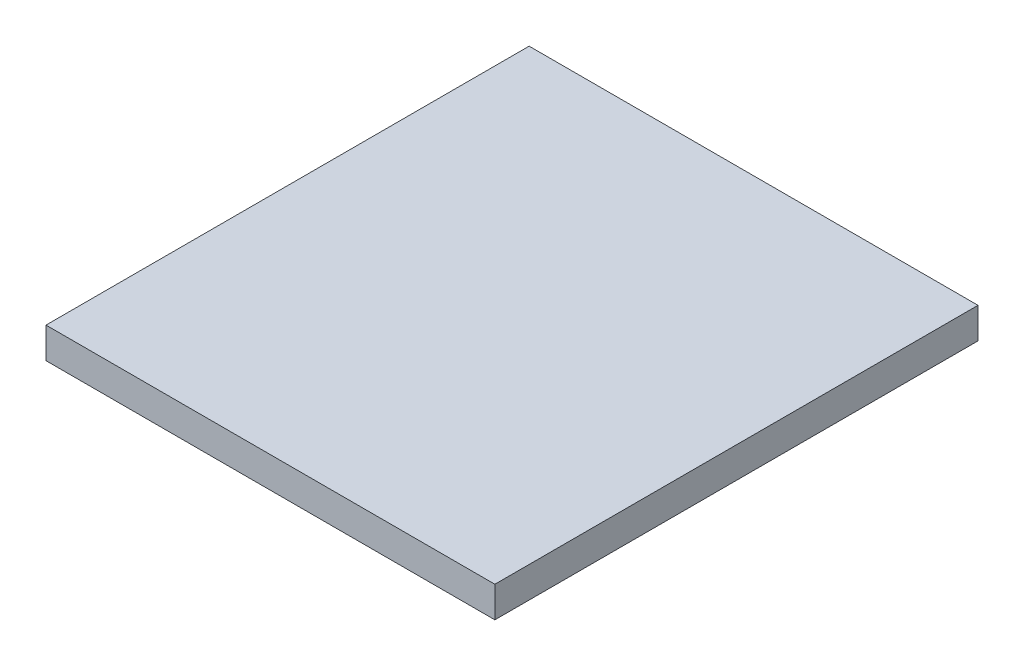
ISO-10303-21;
HEADER;
FILE_DESCRIPTION(('STEP AP214'),'2;1');
FILE_NAME('part.step','',(''),(''),'','','');
FILE_SCHEMA(('AUTOMOTIVE_DESIGN { 1 0 10303 214 1 1 1 1 }'));
ENDSEC;
DATA;
#1=APPLICATION_CONTEXT('core data for automotive mechanical design processes');
#2=APPLICATION_PROTOCOL_DEFINITION('international standard','automotive_design',2000,#1);
#3=PRODUCT_CONTEXT('',#1,'mechanical');
#4=PRODUCT('Part','Part','',(#3));
#5=PRODUCT_RELATED_PRODUCT_CATEGORY('part','',(#4));
#6=PRODUCT_DEFINITION_FORMATION('','',#4);
#7=PRODUCT_DEFINITION_CONTEXT('part definition',#1,'design');
#8=PRODUCT_DEFINITION('design','',#6,#7);
#9=PRODUCT_DEFINITION_SHAPE('','',#8);
#10=(LENGTH_UNIT() NAMED_UNIT(*) SI_UNIT(.MILLI.,.METRE.));
#11=(NAMED_UNIT(*) PLANE_ANGLE_UNIT() SI_UNIT($,.RADIAN.));
#12=(NAMED_UNIT(*) SI_UNIT($,.STERADIAN.) SOLID_ANGLE_UNIT());
#13=UNCERTAINTY_MEASURE_WITH_UNIT(LENGTH_MEASURE(1.E-05),#10,'distance_accuracy_value','');
#14=(GEOMETRIC_REPRESENTATION_CONTEXT(3) GLOBAL_UNCERTAINTY_ASSIGNED_CONTEXT((#13)) GLOBAL_UNIT_ASSIGNED_CONTEXT((#10,
#11,#12)) REPRESENTATION_CONTEXT('',''));
#15=CARTESIAN_POINT('',(0.,0.,0.));
#16=DIRECTION('',(0.,0.,1.));
#17=DIRECTION('',(1.,0.,0.));
#18=AXIS2_PLACEMENT_3D('',#15,#16,#17);
#19=CARTESIAN_POINT('',(-131.,18.,141.));
#20=DIRECTION('',(1.,0.,0.));
#21=DIRECTION('',(0.,0.,-1.));
#22=AXIS2_PLACEMENT_3D('',#19,#20,#21);
#23=PLANE('',#22);
#24=DIRECTION('',(0.,0.,1.));
#25=VECTOR('',#24,1.);
#26=CARTESIAN_POINT('',(-131.,0.,141.));
#27=LINE('',#26,#25);
#28=CARTESIAN_POINT('',(-131.,0.,-141.));
#29=VERTEX_POINT('',#28);
#30=CARTESIAN_POINT('',(-131.,0.,141.));
#31=VERTEX_POINT('',#30);
#32=EDGE_CURVE('E98',#29,#31,#27,.T.);
#33=ORIENTED_EDGE('',*,*,#32,.T.);
#34=DIRECTION('',(0.,-1.,0.));
#35=VECTOR('',#34,1.);
#36=CARTESIAN_POINT('',(-131.,18.,141.));
#37=LINE('',#36,#35);
#38=CARTESIAN_POINT('',(-131.,18.,141.));
#39=VERTEX_POINT('',#38);
#40=EDGE_CURVE('E11',#39,#31,#37,.T.);
#41=ORIENTED_EDGE('',*,*,#40,.F.);
#42=DIRECTION('',(0.,0.,1.));
#43=VECTOR('',#42,1.);
#44=CARTESIAN_POINT('',(-131.,18.,141.));
#45=LINE('',#44,#43);
#46=CARTESIAN_POINT('',(-131.,18.,-141.));
#47=VERTEX_POINT('',#46);
#48=EDGE_CURVE('E86',#47,#39,#45,.T.);
#49=ORIENTED_EDGE('',*,*,#48,.F.);
#50=DIRECTION('',(0.,-1.,0.));
#51=VECTOR('',#50,1.);
#52=CARTESIAN_POINT('',(-131.,18.,-141.));
#53=LINE('',#52,#51);
#54=EDGE_CURVE('E94',#47,#29,#53,.T.);
#55=ORIENTED_EDGE('',*,*,#54,.T.);
#56=EDGE_LOOP('',(#33,#41,#49,#55));
#57=FACE_BOUND('',#56,.T.);
#58=ADVANCED_FACE('F35',(#57),#23,.F.);
#59=CARTESIAN_POINT('',(131.,18.,141.));
#60=DIRECTION('',(0.,0.,-1.));
#61=DIRECTION('',(-1.,0.,0.));
#62=AXIS2_PLACEMENT_3D('',#59,#60,#61);
#63=PLANE('',#62);
#64=DIRECTION('',(1.,0.,0.));
#65=VECTOR('',#64,1.);
#66=CARTESIAN_POINT('',(131.,0.,141.));
#67=LINE('',#66,#65);
#68=CARTESIAN_POINT('',(131.,0.,141.));
#69=VERTEX_POINT('',#68);
#70=EDGE_CURVE('E90',#31,#69,#67,.T.);
#71=ORIENTED_EDGE('',*,*,#70,.T.);
#72=DIRECTION('',(0.,-1.,0.));
#73=VECTOR('',#72,1.);
#74=CARTESIAN_POINT('',(131.,18.,141.));
#75=LINE('',#74,#73);
#76=CARTESIAN_POINT('',(131.,18.,141.));
#77=VERTEX_POINT('',#76);
#78=EDGE_CURVE('E43',#77,#69,#75,.T.);
#79=ORIENTED_EDGE('',*,*,#78,.F.);
#80=DIRECTION('',(1.,0.,0.));
#81=VECTOR('',#80,1.);
#82=CARTESIAN_POINT('',(131.,18.,141.));
#83=LINE('',#82,#81);
#84=EDGE_CURVE('E81',#39,#77,#83,.T.);
#85=ORIENTED_EDGE('',*,*,#84,.F.);
#86=ORIENTED_EDGE('',*,*,#40,.T.);
#87=EDGE_LOOP('',(#71,#79,#85,#86));
#88=FACE_BOUND('',#87,.T.);
#89=ADVANCED_FACE('F89',(#88),#63,.F.);
#90=CARTESIAN_POINT('',(131.,18.,141.));
#91=DIRECTION('',(-1.,0.,0.));
#92=DIRECTION('',(0.,0.,1.));
#93=AXIS2_PLACEMENT_3D('',#90,#91,#92);
#94=PLANE('',#93);
#95=DIRECTION('',(0.,0.,-1.));
#96=VECTOR('',#95,1.);
#97=CARTESIAN_POINT('',(131.,0.,141.));
#98=LINE('',#97,#96);
#99=CARTESIAN_POINT('',(131.,0.,-141.));
#100=VERTEX_POINT('',#99);
#101=EDGE_CURVE('E68',#69,#100,#98,.T.);
#102=ORIENTED_EDGE('',*,*,#101,.T.);
#103=DIRECTION('',(0.,-1.,0.));
#104=VECTOR('',#103,1.);
#105=CARTESIAN_POINT('',(131.,18.,-141.));
#106=LINE('',#105,#104);
#107=CARTESIAN_POINT('',(131.,18.,-141.));
#108=VERTEX_POINT('',#107);
#109=EDGE_CURVE('E91',#108,#100,#106,.T.);
#110=ORIENTED_EDGE('',*,*,#109,.F.);
#111=DIRECTION('',(0.,0.,-1.));
#112=VECTOR('',#111,1.);
#113=CARTESIAN_POINT('',(131.,18.,141.));
#114=LINE('',#113,#112);
#115=EDGE_CURVE('E84',#77,#108,#114,.T.);
#116=ORIENTED_EDGE('',*,*,#115,.F.);
#117=ORIENTED_EDGE('',*,*,#78,.T.);
#118=EDGE_LOOP('',(#102,#110,#116,#117));
#119=FACE_BOUND('',#118,.T.);
#120=ADVANCED_FACE('F92',(#119),#94,.F.);
#121=CARTESIAN_POINT('',(131.,18.,-141.));
#122=DIRECTION('',(0.,0.,1.));
#123=DIRECTION('',(1.,0.,0.));
#124=AXIS2_PLACEMENT_3D('',#121,#122,#123);
#125=PLANE('',#124);
#126=DIRECTION('',(-1.,0.,0.));
#127=VECTOR('',#126,1.);
#128=CARTESIAN_POINT('',(131.,0.,-141.));
#129=LINE('',#128,#127);
#130=EDGE_CURVE('E74',#100,#29,#129,.T.);
#131=ORIENTED_EDGE('',*,*,#130,.T.);
#132=ORIENTED_EDGE('',*,*,#54,.F.);
#133=DIRECTION('',(-1.,0.,0.));
#134=VECTOR('',#133,1.);
#135=CARTESIAN_POINT('',(131.,18.,-141.));
#136=LINE('',#135,#134);
#137=EDGE_CURVE('E51',#108,#47,#136,.T.);
#138=ORIENTED_EDGE('',*,*,#137,.F.);
#139=ORIENTED_EDGE('',*,*,#109,.T.);
#140=EDGE_LOOP('',(#131,#132,#138,#139));
#141=FACE_BOUND('',#140,.T.);
#142=ADVANCED_FACE('F105',(#141),#125,.F.);
#143=CARTESIAN_POINT('',(0.,18.,0.));
#144=DIRECTION('',(0.,1.,0.));
#145=DIRECTION('',(0.,0.,1.));
#146=AXIS2_PLACEMENT_3D('',#143,#144,#145);
#147=PLANE('',#146);
#148=ORIENTED_EDGE('',*,*,#48,.T.);
#149=ORIENTED_EDGE('',*,*,#84,.T.);
#150=ORIENTED_EDGE('',*,*,#115,.T.);
#151=ORIENTED_EDGE('',*,*,#137,.T.);
#152=EDGE_LOOP('',(#148,#149,#150,#151));
#153=FACE_BOUND('',#152,.T.);
#154=ADVANCED_FACE('F82',(#153),#147,.T.);
#155=CARTESIAN_POINT('',(0.,0.,0.));
#156=DIRECTION('',(0.,1.,0.));
#157=DIRECTION('',(0.,0.,1.));
#158=AXIS2_PLACEMENT_3D('',#155,#156,#157);
#159=PLANE('',#158);
#160=ORIENTED_EDGE('',*,*,#32,.F.);
#161=ORIENTED_EDGE('',*,*,#130,.F.);
#162=ORIENTED_EDGE('',*,*,#101,.F.);
#163=ORIENTED_EDGE('',*,*,#70,.F.);
#164=EDGE_LOOP('',(#160,#161,#162,#163));
#165=FACE_BOUND('',#164,.T.);
#166=ADVANCED_FACE('F108',(#165),#159,.F.);
#167=CLOSED_SHELL('',(#58,#89,#120,#142,#154,#166));
#168=MANIFOLD_SOLID_BREP('B2',#167);
#169=ADVANCED_BREP_SHAPE_REPRESENTATION('',(#18,#168),#14);
#170=SHAPE_DEFINITION_REPRESENTATION(#9,#169);
ENDSEC;
END-ISO-10303-21;
